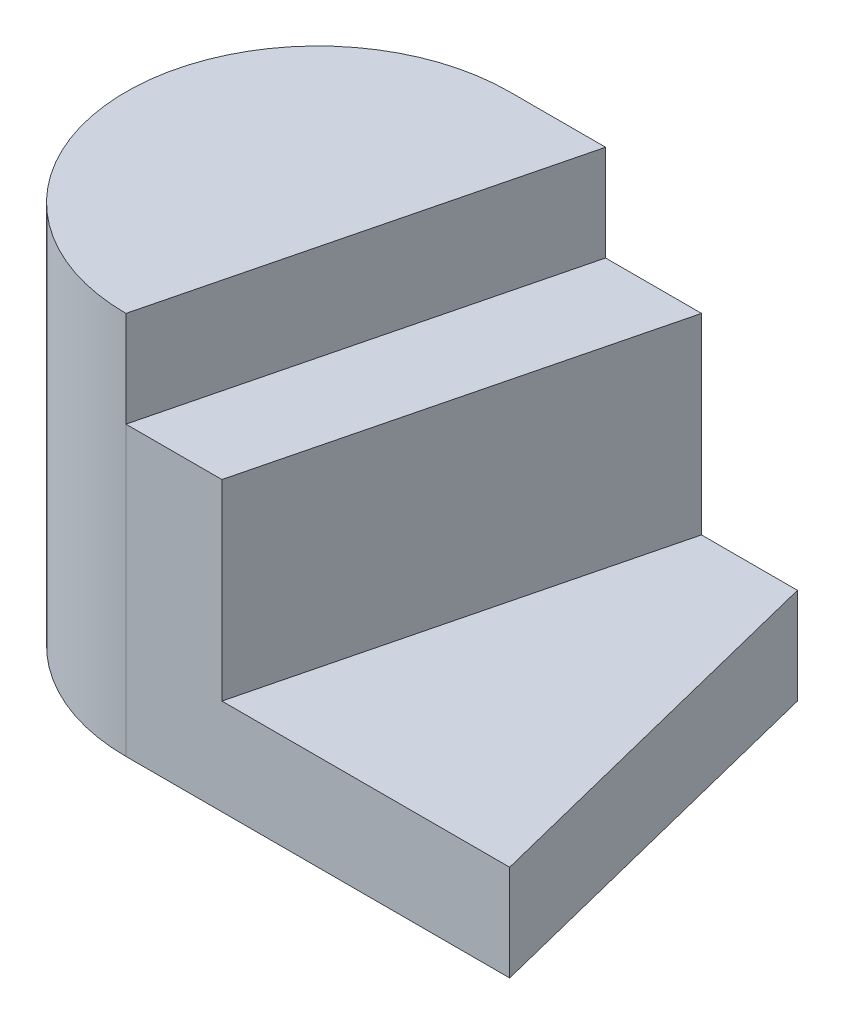
ISO-10303-21;
HEADER;
FILE_DESCRIPTION(('STEP AP214'),'2;1');
FILE_NAME('part.step','',(''),(''),'','','');
FILE_SCHEMA(('AUTOMOTIVE_DESIGN { 1 0 10303 214 1 1 1 1 }'));
ENDSEC;
DATA;
#1=APPLICATION_CONTEXT('core data for automotive mechanical design processes');
#2=APPLICATION_PROTOCOL_DEFINITION('international standard','automotive_design',2000,#1);
#3=PRODUCT_CONTEXT('',#1,'mechanical');
#4=PRODUCT('Part','Part','',(#3));
#5=PRODUCT_RELATED_PRODUCT_CATEGORY('part','',(#4));
#6=PRODUCT_DEFINITION_FORMATION('','',#4);
#7=PRODUCT_DEFINITION_CONTEXT('part definition',#1,'design');
#8=PRODUCT_DEFINITION('design','',#6,#7);
#9=PRODUCT_DEFINITION_SHAPE('','',#8);
#10=(LENGTH_UNIT() NAMED_UNIT(*) SI_UNIT(.MILLI.,.METRE.));
#11=(NAMED_UNIT(*) PLANE_ANGLE_UNIT() SI_UNIT($,.RADIAN.));
#12=(NAMED_UNIT(*) SI_UNIT($,.STERADIAN.) SOLID_ANGLE_UNIT());
#13=UNCERTAINTY_MEASURE_WITH_UNIT(LENGTH_MEASURE(1.E-05),#10,'distance_accuracy_value','');
#14=(GEOMETRIC_REPRESENTATION_CONTEXT(3) GLOBAL_UNCERTAINTY_ASSIGNED_CONTEXT((#13)) GLOBAL_UNIT_ASSIGNED_CONTEXT((#10,
#11,#12)) REPRESENTATION_CONTEXT('',''));
#15=CARTESIAN_POINT('',(0.,0.,0.));
#16=DIRECTION('',(0.,0.,1.));
#17=DIRECTION('',(1.,0.,0.));
#18=AXIS2_PLACEMENT_3D('',#15,#16,#17);
#19=CARTESIAN_POINT('',(0.,40.,-40.));
#20=DIRECTION('',(0.,0.,1.));
#21=DIRECTION('',(1.,0.,0.));
#22=AXIS2_PLACEMENT_3D('',#19,#20,#21);
#23=PLANE('',#22);
#24=DIRECTION('',(-1.,0.,0.));
#25=VECTOR('',#24,1.);
#26=CARTESIAN_POINT('',(0.,0.,-40.));
#27=LINE('',#26,#25);
#28=CARTESIAN_POINT('',(-10.,0.,-40.));
#29=VERTEX_POINT('',#28);
#30=CARTESIAN_POINT('',(-40.,0.,-40.));
#31=VERTEX_POINT('',#30);
#32=EDGE_CURVE('E157',#29,#31,#27,.T.);
#33=ORIENTED_EDGE('',*,*,#32,.T.);
#34=DIRECTION('',(0.,-1.,0.));
#35=VECTOR('',#34,1.);
#36=CARTESIAN_POINT('',(-40.,40.,-40.));
#37=LINE('',#36,#35);
#38=CARTESIAN_POINT('',(-40.,40.,-40.));
#39=VERTEX_POINT('',#38);
#40=EDGE_CURVE('E11',#39,#31,#37,.T.);
#41=ORIENTED_EDGE('',*,*,#40,.F.);
#42=DIRECTION('',(-1.,0.,0.));
#43=VECTOR('',#42,1.);
#44=CARTESIAN_POINT('',(0.,40.,-40.));
#45=LINE('',#44,#43);
#46=CARTESIAN_POINT('',(-30.,40.,-40.));
#47=VERTEX_POINT('',#46);
#48=EDGE_CURVE('E158',#47,#39,#45,.T.);
#49=ORIENTED_EDGE('',*,*,#48,.F.);
#50=DIRECTION('',(0.,-1.,0.));
#51=VECTOR('',#50,1.);
#52=CARTESIAN_POINT('',(-30.,40.,-40.));
#53=LINE('',#52,#51);
#54=CARTESIAN_POINT('',(-30.,30.,-40.));
#55=VERTEX_POINT('',#54);
#56=EDGE_CURVE('E170',#47,#55,#53,.T.);
#57=ORIENTED_EDGE('',*,*,#56,.T.);
#58=DIRECTION('',(-1.,0.,0.));
#59=VECTOR('',#58,1.);
#60=CARTESIAN_POINT('',(0.,30.,-40.));
#61=LINE('',#60,#59);
#62=CARTESIAN_POINT('',(-20.,30.,-40.));
#63=VERTEX_POINT('',#62);
#64=EDGE_CURVE('E138',#63,#55,#61,.T.);
#65=ORIENTED_EDGE('',*,*,#64,.F.);
#66=DIRECTION('',(0.,-1.,0.));
#67=VECTOR('',#66,1.);
#68=CARTESIAN_POINT('',(-20.,30.,-40.));
#69=LINE('',#68,#67);
#70=CARTESIAN_POINT('',(-20.,10.,-40.));
#71=VERTEX_POINT('',#70);
#72=EDGE_CURVE('E154',#63,#71,#69,.T.);
#73=ORIENTED_EDGE('',*,*,#72,.T.);
#74=DIRECTION('',(-1.,0.,0.));
#75=VECTOR('',#74,1.);
#76=CARTESIAN_POINT('',(0.,10.,-40.));
#77=LINE('',#76,#75);
#78=CARTESIAN_POINT('',(-10.,10.,-40.));
#79=VERTEX_POINT('',#78);
#80=EDGE_CURVE('E133',#79,#71,#77,.T.);
#81=ORIENTED_EDGE('',*,*,#80,.F.);
#82=DIRECTION('',(0.,-1.,0.));
#83=VECTOR('',#82,1.);
#84=CARTESIAN_POINT('',(-10.,10.,-40.));
#85=LINE('',#84,#83);
#86=EDGE_CURVE('E120',#79,#29,#85,.T.);
#87=ORIENTED_EDGE('',*,*,#86,.T.);
#88=EDGE_LOOP('',(#33,#41,#49,#57,#65,#73,#81,#87));
#89=FACE_BOUND('',#88,.T.);
#90=ADVANCED_FACE('F41',(#89),#23,.F.);
#91=CARTESIAN_POINT('',(-40.,40.,-20.));
#92=DIRECTION('',(0.,-1.,0.));
#93=DIRECTION('',(0.,0.,-1.));
#94=AXIS2_PLACEMENT_3D('',#91,#92,#93);
#95=CYLINDRICAL_SURFACE('',#94,20.);
#96=CARTESIAN_POINT('',(-40.,0.,-20.));
#97=DIRECTION('',(0.,1.,0.));
#98=DIRECTION('',(0.,0.,1.));
#99=AXIS2_PLACEMENT_3D('',#96,#97,#98);
#100=CIRCLE('',#99,20.);
#101=CARTESIAN_POINT('',(-40.,0.,0.));
#102=VERTEX_POINT('',#101);
#103=EDGE_CURVE('E163',#31,#102,#100,.T.);
#104=ORIENTED_EDGE('',*,*,#103,.T.);
#105=DIRECTION('',(0.,-1.,0.));
#106=VECTOR('',#105,1.);
#107=CARTESIAN_POINT('',(-40.,30.,0.));
#108=LINE('',#107,#106);
#109=CARTESIAN_POINT('',(-40.,30.,0.));
#110=VERTEX_POINT('',#109);
#111=EDGE_CURVE('E151',#110,#102,#108,.T.);
#112=ORIENTED_EDGE('',*,*,#111,.F.);
#113=DIRECTION('',(0.,-1.,0.));
#114=VECTOR('',#113,1.);
#115=CARTESIAN_POINT('',(-40.,40.,0.));
#116=LINE('',#115,#114);
#117=CARTESIAN_POINT('',(-40.,40.,0.));
#118=VERTEX_POINT('',#117);
#119=EDGE_CURVE('E49',#118,#110,#116,.T.);
#120=ORIENTED_EDGE('',*,*,#119,.F.);
#121=CARTESIAN_POINT('',(-40.,40.,-20.));
#122=DIRECTION('',(0.,1.,0.));
#123=DIRECTION('',(0.,0.,1.));
#124=AXIS2_PLACEMENT_3D('',#121,#122,#123);
#125=CIRCLE('',#124,20.);
#126=EDGE_CURVE('E162',#39,#118,#125,.T.);
#127=ORIENTED_EDGE('',*,*,#126,.F.);
#128=ORIENTED_EDGE('',*,*,#40,.T.);
#129=EDGE_LOOP('',(#104,#112,#120,#127,#128));
#130=FACE_BOUND('',#129,.T.);
#131=ADVANCED_FACE('F188',(#130),#95,.T.);
#132=CARTESIAN_POINT('',(-37.6470588235294,40.,-9.41176470588236));
#133=DIRECTION('',(0.970142500145332,0.,0.242535625036333));
#134=DIRECTION('',(0.242535625036333,0.,-0.970142500145332));
#135=AXIS2_PLACEMENT_3D('',#132,#133,#134);
#136=PLANE('',#135);
#137=DIRECTION('',(-0.242535625036333,0.,0.970142500145332));
#138=VECTOR('',#137,1.);
#139=CARTESIAN_POINT('',(-37.6470588235294,30.,-9.41176470588236));
#140=LINE('',#139,#138);
#141=EDGE_CURVE('E141',#55,#110,#140,.T.);
#142=ORIENTED_EDGE('',*,*,#141,.F.);
#143=ORIENTED_EDGE('',*,*,#56,.F.);
#144=DIRECTION('',(-0.242535625036333,0.,0.970142500145332));
#145=VECTOR('',#144,1.);
#146=CARTESIAN_POINT('',(-37.6470588235294,40.,-9.41176470588236));
#147=LINE('',#146,#145);
#148=EDGE_CURVE('E166',#47,#118,#147,.T.);
#149=ORIENTED_EDGE('',*,*,#148,.T.);
#150=ORIENTED_EDGE('',*,*,#119,.T.);
#151=EDGE_LOOP('',(#142,#143,#149,#150));
#152=FACE_BOUND('',#151,.T.);
#153=ADVANCED_FACE('F184',(#152),#136,.T.);
#154=CARTESIAN_POINT('',(0.,40.,0.));
#155=DIRECTION('',(0.,1.,0.));
#156=DIRECTION('',(0.,0.,1.));
#157=AXIS2_PLACEMENT_3D('',#154,#155,#156);
#158=PLANE('',#157);
#159=ORIENTED_EDGE('',*,*,#48,.T.);
#160=ORIENTED_EDGE('',*,*,#126,.T.);
#161=ORIENTED_EDGE('',*,*,#148,.F.);
#162=EDGE_LOOP('',(#159,#160,#161));
#163=FACE_BOUND('',#162,.T.);
#164=ADVANCED_FACE('F198',(#163),#158,.T.);
#165=CARTESIAN_POINT('',(0.,0.,0.));
#166=DIRECTION('',(0.,1.,0.));
#167=DIRECTION('',(0.,0.,1.));
#168=AXIS2_PLACEMENT_3D('',#165,#166,#167);
#169=PLANE('',#168);
#170=ORIENTED_EDGE('',*,*,#32,.F.);
#171=DIRECTION('',(-0.242535625036333,0.,-0.970142500145332));
#172=VECTOR('',#171,1.);
#173=CARTESIAN_POINT('',(0.,0.,0.));
#174=LINE('',#173,#172);
#175=CARTESIAN_POINT('',(0.,0.,0.));
#176=VERTEX_POINT('',#175);
#177=EDGE_CURVE('E131',#176,#29,#174,.T.);
#178=ORIENTED_EDGE('',*,*,#177,.F.);
#179=DIRECTION('',(1.,0.,0.));
#180=VECTOR('',#179,1.);
#181=CARTESIAN_POINT('',(0.,0.,0.));
#182=LINE('',#181,#180);
#183=EDGE_CURVE('E115',#102,#176,#182,.T.);
#184=ORIENTED_EDGE('',*,*,#183,.F.);
#185=ORIENTED_EDGE('',*,*,#103,.F.);
#186=EDGE_LOOP('',(#170,#178,#184,#185));
#187=FACE_BOUND('',#186,.T.);
#188=ADVANCED_FACE('F200',(#187),#169,.F.);
#189=CARTESIAN_POINT('',(-28.2352941176471,30.,-7.05882352941176));
#190=DIRECTION('',(0.970142500145332,0.,0.242535625036333));
#191=DIRECTION('',(0.242535625036333,0.,-0.970142500145332));
#192=AXIS2_PLACEMENT_3D('',#189,#190,#191);
#193=PLANE('',#192);
#194=DIRECTION('',(-0.242535625036333,0.,0.970142500145332));
#195=VECTOR('',#194,1.);
#196=CARTESIAN_POINT('',(-28.2352941176471,10.,-7.05882352941176));
#197=LINE('',#196,#195);
#198=CARTESIAN_POINT('',(-30.,10.,0.));
#199=VERTEX_POINT('',#198);
#200=EDGE_CURVE('E56',#71,#199,#197,.T.);
#201=ORIENTED_EDGE('',*,*,#200,.F.);
#202=ORIENTED_EDGE('',*,*,#72,.F.);
#203=DIRECTION('',(-0.242535625036333,0.,0.970142500145332));
#204=VECTOR('',#203,1.);
#205=CARTESIAN_POINT('',(-28.2352941176471,30.,-7.05882352941176));
#206=LINE('',#205,#204);
#207=CARTESIAN_POINT('',(-30.,30.,0.));
#208=VERTEX_POINT('',#207);
#209=EDGE_CURVE('E135',#63,#208,#206,.T.);
#210=ORIENTED_EDGE('',*,*,#209,.T.);
#211=DIRECTION('',(0.,-1.,0.));
#212=VECTOR('',#211,1.);
#213=CARTESIAN_POINT('',(-30.,30.,0.));
#214=LINE('',#213,#212);
#215=EDGE_CURVE('E61',#208,#199,#214,.T.);
#216=ORIENTED_EDGE('',*,*,#215,.T.);
#217=EDGE_LOOP('',(#201,#202,#210,#216));
#218=FACE_BOUND('',#217,.T.);
#219=ADVANCED_FACE('F206',(#218),#193,.T.);
#220=CARTESIAN_POINT('',(0.,30.,0.));
#221=DIRECTION('',(0.,0.,-1.));
#222=DIRECTION('',(-1.,0.,0.));
#223=AXIS2_PLACEMENT_3D('',#220,#221,#222);
#224=PLANE('',#223);
#225=ORIENTED_EDGE('',*,*,#183,.T.);
#226=DIRECTION('',(0.,-1.,0.));
#227=VECTOR('',#226,1.);
#228=CARTESIAN_POINT('',(0.,10.,0.));
#229=LINE('',#228,#227);
#230=CARTESIAN_POINT('',(0.,10.,0.));
#231=VERTEX_POINT('',#230);
#232=EDGE_CURVE('E112',#231,#176,#229,.T.);
#233=ORIENTED_EDGE('',*,*,#232,.F.);
#234=DIRECTION('',(1.,0.,0.));
#235=VECTOR('',#234,1.);
#236=CARTESIAN_POINT('',(0.,10.,0.));
#237=LINE('',#236,#235);
#238=EDGE_CURVE('E101',#199,#231,#237,.T.);
#239=ORIENTED_EDGE('',*,*,#238,.F.);
#240=ORIENTED_EDGE('',*,*,#215,.F.);
#241=DIRECTION('',(1.,0.,0.));
#242=VECTOR('',#241,1.);
#243=CARTESIAN_POINT('',(0.,30.,0.));
#244=LINE('',#243,#242);
#245=EDGE_CURVE('E144',#110,#208,#244,.T.);
#246=ORIENTED_EDGE('',*,*,#245,.F.);
#247=ORIENTED_EDGE('',*,*,#111,.T.);
#248=EDGE_LOOP('',(#225,#233,#239,#240,#246,#247));
#249=FACE_BOUND('',#248,.T.);
#250=ADVANCED_FACE('F113',(#249),#224,.F.);
#251=CARTESIAN_POINT('',(0.,30.,0.));
#252=DIRECTION('',(0.,1.,0.));
#253=DIRECTION('',(0.,0.,1.));
#254=AXIS2_PLACEMENT_3D('',#251,#252,#253);
#255=PLANE('',#254);
#256=ORIENTED_EDGE('',*,*,#209,.F.);
#257=ORIENTED_EDGE('',*,*,#64,.T.);
#258=ORIENTED_EDGE('',*,*,#141,.T.);
#259=ORIENTED_EDGE('',*,*,#245,.T.);
#260=EDGE_LOOP('',(#256,#257,#258,#259));
#261=FACE_BOUND('',#260,.T.);
#262=ADVANCED_FACE('F192',(#261),#255,.T.);
#263=CARTESIAN_POINT('',(0.,10.,0.));
#264=DIRECTION('',(-0.970142500145332,0.,0.242535625036333));
#265=DIRECTION('',(0.242535625036333,0.,0.970142500145332));
#266=AXIS2_PLACEMENT_3D('',#263,#264,#265);
#267=PLANE('',#266);
#268=ORIENTED_EDGE('',*,*,#177,.T.);
#269=ORIENTED_EDGE('',*,*,#86,.F.);
#270=DIRECTION('',(-0.242535625036333,0.,-0.970142500145332));
#271=VECTOR('',#270,1.);
#272=CARTESIAN_POINT('',(0.,10.,0.));
#273=LINE('',#272,#271);
#274=EDGE_CURVE('E106',#231,#79,#273,.T.);
#275=ORIENTED_EDGE('',*,*,#274,.F.);
#276=ORIENTED_EDGE('',*,*,#232,.T.);
#277=EDGE_LOOP('',(#268,#269,#275,#276));
#278=FACE_BOUND('',#277,.T.);
#279=ADVANCED_FACE('F122',(#278),#267,.F.);
#280=CARTESIAN_POINT('',(0.,10.,0.));
#281=DIRECTION('',(0.,1.,0.));
#282=DIRECTION('',(0.,0.,1.));
#283=AXIS2_PLACEMENT_3D('',#280,#281,#282);
#284=PLANE('',#283);
#285=ORIENTED_EDGE('',*,*,#80,.T.);
#286=ORIENTED_EDGE('',*,*,#200,.T.);
#287=ORIENTED_EDGE('',*,*,#238,.T.);
#288=ORIENTED_EDGE('',*,*,#274,.T.);
#289=EDGE_LOOP('',(#285,#286,#287,#288));
#290=FACE_BOUND('',#289,.T.);
#291=ADVANCED_FACE('F104',(#290),#284,.T.);
#292=CLOSED_SHELL('',(#90,#131,#153,#164,#188,#219,#250,#262,#279,#291));
#293=MANIFOLD_SOLID_BREP('B2',#292);
#294=ADVANCED_BREP_SHAPE_REPRESENTATION('',(#18,#293),#14);
#295=SHAPE_DEFINITION_REPRESENTATION(#9,#294);
ENDSEC;
END-ISO-10303-21;
